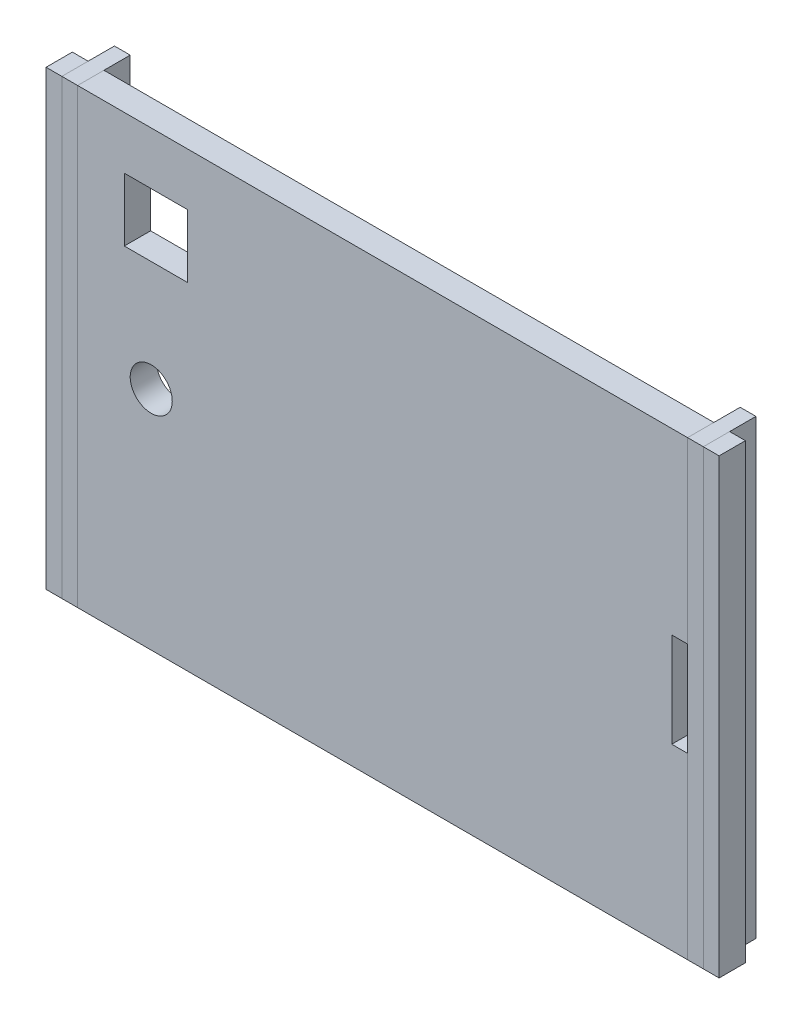
ISO-10303-21;
HEADER;
FILE_DESCRIPTION(('STEP AP214'),'2;1');
FILE_NAME('part.step','',(''),(''),'','','');
FILE_SCHEMA(('AUTOMOTIVE_DESIGN { 1 0 10303 214 1 1 1 1 }'));
ENDSEC;
DATA;
#1=APPLICATION_CONTEXT('core data for automotive mechanical design processes');
#2=APPLICATION_PROTOCOL_DEFINITION('international standard','automotive_design',2000,#1);
#3=PRODUCT_CONTEXT('',#1,'mechanical');
#4=PRODUCT('Part','Part','',(#3));
#5=PRODUCT_RELATED_PRODUCT_CATEGORY('part','',(#4));
#6=PRODUCT_DEFINITION_FORMATION('','',#4);
#7=PRODUCT_DEFINITION_CONTEXT('part definition',#1,'design');
#8=PRODUCT_DEFINITION('design','',#6,#7);
#9=PRODUCT_DEFINITION_SHAPE('','',#8);
#10=(LENGTH_UNIT() NAMED_UNIT(*) SI_UNIT(.MILLI.,.METRE.));
#11=(NAMED_UNIT(*) PLANE_ANGLE_UNIT() SI_UNIT($,.RADIAN.));
#12=(NAMED_UNIT(*) SI_UNIT($,.STERADIAN.) SOLID_ANGLE_UNIT());
#13=UNCERTAINTY_MEASURE_WITH_UNIT(LENGTH_MEASURE(1.E-05),#10,'distance_accuracy_value','');
#14=(GEOMETRIC_REPRESENTATION_CONTEXT(3) GLOBAL_UNCERTAINTY_ASSIGNED_CONTEXT((#13)) GLOBAL_UNIT_ASSIGNED_CONTEXT((#10,
#11,#12)) REPRESENTATION_CONTEXT('',''));
#15=CARTESIAN_POINT('',(0.,0.,0.));
#16=DIRECTION('',(0.,0.,1.));
#17=DIRECTION('',(1.,0.,0.));
#18=AXIS2_PLACEMENT_3D('',#15,#16,#17);
#19=CARTESIAN_POINT('',(0.,-37.7760362988326,-10.));
#20=DIRECTION('',(0.,-1.,0.));
#21=DIRECTION('',(1.,0.,0.));
#22=AXIS2_PLACEMENT_3D('',#19,#20,#21);
#23=PLANE('',#22);
#24=DIRECTION('',(1.,0.,0.));
#25=VECTOR('',#24,1.);
#26=CARTESIAN_POINT('',(0.,-37.7760362988326,0.));
#27=LINE('',#26,#25);
#28=CARTESIAN_POINT('',(18.7536611522235,-37.7760362988326,0.));
#29=VERTEX_POINT('',#28);
#30=CARTESIAN_POINT('',(21.7536611522235,-37.7760362988326,0.));
#31=VERTEX_POINT('',#30);
#32=EDGE_CURVE('E112',#29,#31,#27,.T.);
#33=ORIENTED_EDGE('',*,*,#32,.F.);
#34=DIRECTION('',(0.,0.,1.));
#35=VECTOR('',#34,1.);
#36=CARTESIAN_POINT('',(18.7536611522235,-37.7760362988326,-10.));
#37=LINE('',#36,#35);
#38=CARTESIAN_POINT('',(18.7536611522235,-37.7760362988326,-10.));
#39=VERTEX_POINT('',#38);
#40=EDGE_CURVE('E12',#39,#29,#37,.T.);
#41=ORIENTED_EDGE('',*,*,#40,.F.);
#42=DIRECTION('',(1.,0.,0.));
#43=VECTOR('',#42,1.);
#44=CARTESIAN_POINT('',(0.,-37.7760362988326,-10.));
#45=LINE('',#44,#43);
#46=CARTESIAN_POINT('',(21.7536611522235,-37.7760362988326,-10.));
#47=VERTEX_POINT('',#46);
#48=EDGE_CURVE('E106',#39,#47,#45,.T.);
#49=ORIENTED_EDGE('',*,*,#48,.T.);
#50=DIRECTION('',(0.,0.,1.));
#51=VECTOR('',#50,1.);
#52=CARTESIAN_POINT('',(21.7536611522235,-37.7760362988326,-10.));
#53=LINE('',#52,#51);
#54=EDGE_CURVE('E51',#47,#31,#53,.T.);
#55=ORIENTED_EDGE('',*,*,#54,.T.);
#56=EDGE_LOOP('',(#33,#41,#49,#55));
#57=FACE_BOUND('',#56,.T.);
#58=ADVANCED_FACE('F48',(#57),#23,.T.);
#59=CARTESIAN_POINT('',(18.7536611522235,0.,-10.));
#60=DIRECTION('',(-1.,0.,0.));
#61=DIRECTION('',(0.,-1.,0.));
#62=AXIS2_PLACEMENT_3D('',#59,#60,#61);
#63=PLANE('',#62);
#64=DIRECTION('',(0.,-1.,0.));
#65=VECTOR('',#64,1.);
#66=CARTESIAN_POINT('',(18.7536611522235,0.,0.));
#67=LINE('',#66,#65);
#68=CARTESIAN_POINT('',(18.7536611522235,48.2239637011674,0.));
#69=VERTEX_POINT('',#68);
#70=EDGE_CURVE('E108',#69,#29,#67,.T.);
#71=ORIENTED_EDGE('',*,*,#70,.F.);
#72=DIRECTION('',(0.,0.,1.));
#73=VECTOR('',#72,1.);
#74=CARTESIAN_POINT('',(18.7536611522235,48.2239637011674,-10.));
#75=LINE('',#74,#73);
#76=CARTESIAN_POINT('',(18.7536611522235,48.2239637011674,-10.));
#77=VERTEX_POINT('',#76);
#78=EDGE_CURVE('E57',#77,#69,#75,.T.);
#79=ORIENTED_EDGE('',*,*,#78,.F.);
#80=DIRECTION('',(0.,-1.,0.));
#81=VECTOR('',#80,1.);
#82=CARTESIAN_POINT('',(18.7536611522235,0.,-10.));
#83=LINE('',#82,#81);
#84=EDGE_CURVE('E99',#77,#39,#83,.T.);
#85=ORIENTED_EDGE('',*,*,#84,.T.);
#86=ORIENTED_EDGE('',*,*,#40,.T.);
#87=EDGE_LOOP('',(#71,#79,#85,#86));
#88=FACE_BOUND('',#87,.T.);
#89=ADVANCED_FACE('F122',(#88),#63,.T.);
#90=CARTESIAN_POINT('',(0.,48.2239637011674,-10.));
#91=DIRECTION('',(0.,-1.,0.));
#92=DIRECTION('',(0.,0.,-1.));
#93=AXIS2_PLACEMENT_3D('',#90,#91,#92);
#94=PLANE('',#93);
#95=DIRECTION('',(1.,0.,0.));
#96=VECTOR('',#95,1.);
#97=CARTESIAN_POINT('',(0.,48.2239637011674,0.));
#98=LINE('',#97,#96);
#99=CARTESIAN_POINT('',(21.7536611522235,48.2239637011674,0.));
#100=VERTEX_POINT('',#99);
#101=EDGE_CURVE('E103',#69,#100,#98,.T.);
#102=ORIENTED_EDGE('',*,*,#101,.T.);
#103=DIRECTION('',(0.,0.,1.));
#104=VECTOR('',#103,1.);
#105=CARTESIAN_POINT('',(21.7536611522235,48.2239637011674,-10.));
#106=LINE('',#105,#104);
#107=CARTESIAN_POINT('',(21.7536611522235,48.2239637011674,-10.));
#108=VERTEX_POINT('',#107);
#109=EDGE_CURVE('E101',#108,#100,#106,.T.);
#110=ORIENTED_EDGE('',*,*,#109,.F.);
#111=DIRECTION('',(1.,0.,0.));
#112=VECTOR('',#111,1.);
#113=CARTESIAN_POINT('',(0.,48.2239637011674,-10.));
#114=LINE('',#113,#112);
#115=EDGE_CURVE('E95',#77,#108,#114,.T.);
#116=ORIENTED_EDGE('',*,*,#115,.F.);
#117=ORIENTED_EDGE('',*,*,#78,.T.);
#118=EDGE_LOOP('',(#102,#110,#116,#117));
#119=FACE_BOUND('',#118,.T.);
#120=ADVANCED_FACE('F102',(#119),#94,.F.);
#121=CARTESIAN_POINT('',(21.7536611522235,0.,-10.));
#122=DIRECTION('',(1.,0.,0.));
#123=DIRECTION('',(0.,0.,-1.));
#124=AXIS2_PLACEMENT_3D('',#121,#122,#123);
#125=PLANE('',#124);
#126=DIRECTION('',(0.,1.,0.));
#127=VECTOR('',#126,1.);
#128=CARTESIAN_POINT('',(21.7536611522235,0.,0.));
#129=LINE('',#128,#127);
#130=EDGE_CURVE('E115',#31,#100,#129,.T.);
#131=ORIENTED_EDGE('',*,*,#130,.F.);
#132=ORIENTED_EDGE('',*,*,#54,.F.);
#133=DIRECTION('',(0.,1.,0.));
#134=VECTOR('',#133,1.);
#135=CARTESIAN_POINT('',(21.7536611522235,0.,-10.));
#136=LINE('',#135,#134);
#137=EDGE_CURVE('E98',#47,#108,#136,.T.);
#138=ORIENTED_EDGE('',*,*,#137,.T.);
#139=ORIENTED_EDGE('',*,*,#109,.T.);
#140=EDGE_LOOP('',(#131,#132,#138,#139));
#141=FACE_BOUND('',#140,.T.);
#142=ADVANCED_FACE('F105',(#141),#125,.T.);
#143=CARTESIAN_POINT('',(0.,0.,-10.));
#144=DIRECTION('',(0.,0.,1.));
#145=DIRECTION('',(1.,0.,0.));
#146=AXIS2_PLACEMENT_3D('',#143,#144,#145);
#147=PLANE('',#146);
#148=ORIENTED_EDGE('',*,*,#48,.F.);
#149=ORIENTED_EDGE('',*,*,#84,.F.);
#150=ORIENTED_EDGE('',*,*,#115,.T.);
#151=ORIENTED_EDGE('',*,*,#137,.F.);
#152=EDGE_LOOP('',(#148,#149,#150,#151));
#153=FACE_BOUND('',#152,.T.);
#154=ADVANCED_FACE('F97',(#153),#147,.F.);
#155=CARTESIAN_POINT('',(0.,0.,0.));
#156=DIRECTION('',(0.,0.,1.));
#157=DIRECTION('',(1.,0.,0.));
#158=AXIS2_PLACEMENT_3D('',#155,#156,#157);
#159=PLANE('',#158);
#160=ORIENTED_EDGE('',*,*,#32,.T.);
#161=ORIENTED_EDGE('',*,*,#130,.T.);
#162=ORIENTED_EDGE('',*,*,#101,.F.);
#163=ORIENTED_EDGE('',*,*,#70,.T.);
#164=EDGE_LOOP('',(#160,#161,#162,#163));
#165=FACE_BOUND('',#164,.T.);
#166=ADVANCED_FACE('F121',(#165),#159,.T.);
#167=CLOSED_SHELL('',(#58,#89,#120,#142,#154,#166));
#168=MANIFOLD_SOLID_BREP('B2',#167);
#169=CARTESIAN_POINT('',(-100.246338847777,0.,-10.));
#170=DIRECTION('',(1.,0.,0.));
#171=DIRECTION('',(0.,0.,-1.));
#172=AXIS2_PLACEMENT_3D('',#169,#170,#171);
#173=PLANE('',#172);
#174=DIRECTION('',(0.,1.,0.));
#175=VECTOR('',#174,1.);
#176=CARTESIAN_POINT('',(-100.246338847777,0.,0.));
#177=LINE('',#176,#175);
#178=CARTESIAN_POINT('',(-100.246338847777,-37.7760362988326,0.));
#179=VERTEX_POINT('',#178);
#180=CARTESIAN_POINT('',(-100.246338847777,48.2239637011674,0.));
#181=VERTEX_POINT('',#180);
#182=EDGE_CURVE('E255',#179,#181,#177,.T.);
#183=ORIENTED_EDGE('',*,*,#182,.T.);
#184=DIRECTION('',(0.,0.,1.));
#185=VECTOR('',#184,1.);
#186=CARTESIAN_POINT('',(-100.246338847777,48.2239637011674,-10.));
#187=LINE('',#186,#185);
#188=CARTESIAN_POINT('',(-100.246338847777,48.2239637011674,-10.));
#189=VERTEX_POINT('',#188);
#190=EDGE_CURVE('E46',#189,#181,#187,.T.);
#191=ORIENTED_EDGE('',*,*,#190,.F.);
#192=DIRECTION('',(0.,1.,0.));
#193=VECTOR('',#192,1.);
#194=CARTESIAN_POINT('',(-100.246338847777,0.,-10.));
#195=LINE('',#194,#193);
#196=CARTESIAN_POINT('',(-100.246338847777,-37.7760362988326,-10.));
#197=VERTEX_POINT('',#196);
#198=EDGE_CURVE('E250',#197,#189,#195,.T.);
#199=ORIENTED_EDGE('',*,*,#198,.F.);
#200=DIRECTION('',(0.,0.,1.));
#201=VECTOR('',#200,1.);
#202=CARTESIAN_POINT('',(-100.246338847777,-37.7760362988326,-10.));
#203=LINE('',#202,#201);
#204=EDGE_CURVE('E194',#197,#179,#203,.T.);
#205=ORIENTED_EDGE('',*,*,#204,.T.);
#206=EDGE_LOOP('',(#183,#191,#199,#205));
#207=FACE_BOUND('',#206,.T.);
#208=ADVANCED_FACE('F191',(#207),#173,.F.);
#209=CARTESIAN_POINT('',(0.,48.2239637011674,-10.));
#210=DIRECTION('',(0.,-1.,0.));
#211=DIRECTION('',(0.,0.,-1.));
#212=AXIS2_PLACEMENT_3D('',#209,#210,#211);
#213=PLANE('',#212);
#214=DIRECTION('',(1.,0.,0.));
#215=VECTOR('',#214,1.);
#216=CARTESIAN_POINT('',(0.,48.2239637011674,0.));
#217=LINE('',#216,#215);
#218=CARTESIAN_POINT('',(-97.2463388477765,48.2239637011674,0.));
#219=VERTEX_POINT('',#218);
#220=EDGE_CURVE('E222',#181,#219,#217,.T.);
#221=ORIENTED_EDGE('',*,*,#220,.T.);
#222=DIRECTION('',(0.,0.,1.));
#223=VECTOR('',#222,1.);
#224=CARTESIAN_POINT('',(-97.2463388477765,48.2239637011674,-10.));
#225=LINE('',#224,#223);
#226=CARTESIAN_POINT('',(-97.2463388477765,48.2239637011674,-10.));
#227=VERTEX_POINT('',#226);
#228=EDGE_CURVE('E200',#227,#219,#225,.T.);
#229=ORIENTED_EDGE('',*,*,#228,.F.);
#230=DIRECTION('',(1.,0.,0.));
#231=VECTOR('',#230,1.);
#232=CARTESIAN_POINT('',(0.,48.2239637011674,-10.));
#233=LINE('',#232,#231);
#234=EDGE_CURVE('E208',#189,#227,#233,.T.);
#235=ORIENTED_EDGE('',*,*,#234,.F.);
#236=ORIENTED_EDGE('',*,*,#190,.T.);
#237=EDGE_LOOP('',(#221,#229,#235,#236));
#238=FACE_BOUND('',#237,.T.);
#239=ADVANCED_FACE('F265',(#238),#213,.F.);
#240=CARTESIAN_POINT('',(-97.2463388477765,0.,-10.));
#241=DIRECTION('',(-1.,0.,0.));
#242=DIRECTION('',(0.,-1.,0.));
#243=AXIS2_PLACEMENT_3D('',#240,#241,#242);
#244=PLANE('',#243);
#245=DIRECTION('',(0.,-1.,0.));
#246=VECTOR('',#245,1.);
#247=CARTESIAN_POINT('',(-97.2463388477765,0.,0.));
#248=LINE('',#247,#246);
#249=CARTESIAN_POINT('',(-97.2463388477765,-37.7760362988326,0.));
#250=VERTEX_POINT('',#249);
#251=EDGE_CURVE('E247',#219,#250,#248,.T.);
#252=ORIENTED_EDGE('',*,*,#251,.T.);
#253=DIRECTION('',(0.,0.,1.));
#254=VECTOR('',#253,1.);
#255=CARTESIAN_POINT('',(-97.2463388477765,-37.7760362988326,-10.));
#256=LINE('',#255,#254);
#257=CARTESIAN_POINT('',(-97.2463388477765,-37.7760362988326,-10.));
#258=VERTEX_POINT('',#257);
#259=EDGE_CURVE('E245',#258,#250,#256,.T.);
#260=ORIENTED_EDGE('',*,*,#259,.F.);
#261=DIRECTION('',(0.,-1.,0.));
#262=VECTOR('',#261,1.);
#263=CARTESIAN_POINT('',(-97.2463388477765,0.,-10.));
#264=LINE('',#263,#262);
#265=EDGE_CURVE('E238',#227,#258,#264,.T.);
#266=ORIENTED_EDGE('',*,*,#265,.F.);
#267=ORIENTED_EDGE('',*,*,#228,.T.);
#268=EDGE_LOOP('',(#252,#260,#266,#267));
#269=FACE_BOUND('',#268,.T.);
#270=ADVANCED_FACE('F246',(#269),#244,.F.);
#271=CARTESIAN_POINT('',(0.,-37.7760362988326,-10.));
#272=DIRECTION('',(0.,-1.,0.));
#273=DIRECTION('',(1.,0.,0.));
#274=AXIS2_PLACEMENT_3D('',#271,#272,#273);
#275=PLANE('',#274);
#276=DIRECTION('',(1.,0.,0.));
#277=VECTOR('',#276,1.);
#278=CARTESIAN_POINT('',(0.,-37.7760362988326,0.));
#279=LINE('',#278,#277);
#280=EDGE_CURVE('E258',#179,#250,#279,.T.);
#281=ORIENTED_EDGE('',*,*,#280,.F.);
#282=ORIENTED_EDGE('',*,*,#204,.F.);
#283=DIRECTION('',(1.,0.,0.));
#284=VECTOR('',#283,1.);
#285=CARTESIAN_POINT('',(0.,-37.7760362988326,-10.));
#286=LINE('',#285,#284);
#287=EDGE_CURVE('E241',#197,#258,#286,.T.);
#288=ORIENTED_EDGE('',*,*,#287,.T.);
#289=ORIENTED_EDGE('',*,*,#259,.T.);
#290=EDGE_LOOP('',(#281,#282,#288,#289));
#291=FACE_BOUND('',#290,.T.);
#292=ADVANCED_FACE('F249',(#291),#275,.T.);
#293=CARTESIAN_POINT('',(0.,0.,-10.));
#294=DIRECTION('',(0.,0.,1.));
#295=DIRECTION('',(1.,0.,0.));
#296=AXIS2_PLACEMENT_3D('',#293,#294,#295);
#297=PLANE('',#296);
#298=ORIENTED_EDGE('',*,*,#198,.T.);
#299=ORIENTED_EDGE('',*,*,#234,.T.);
#300=ORIENTED_EDGE('',*,*,#265,.T.);
#301=ORIENTED_EDGE('',*,*,#287,.F.);
#302=EDGE_LOOP('',(#298,#299,#300,#301));
#303=FACE_BOUND('',#302,.T.);
#304=ADVANCED_FACE('F240',(#303),#297,.F.);
#305=CARTESIAN_POINT('',(0.,0.,0.));
#306=DIRECTION('',(0.,0.,1.));
#307=DIRECTION('',(1.,0.,0.));
#308=AXIS2_PLACEMENT_3D('',#305,#306,#307);
#309=PLANE('',#308);
#310=ORIENTED_EDGE('',*,*,#182,.F.);
#311=ORIENTED_EDGE('',*,*,#280,.T.);
#312=ORIENTED_EDGE('',*,*,#251,.F.);
#313=ORIENTED_EDGE('',*,*,#220,.F.);
#314=EDGE_LOOP('',(#310,#311,#312,#313));
#315=FACE_BOUND('',#314,.T.);
#316=ADVANCED_FACE('F262',(#315),#309,.T.);
#317=CLOSED_SHELL('',(#208,#239,#270,#292,#304,#316));
#318=MANIFOLD_SOLID_BREP('B6',#317);
#319=CARTESIAN_POINT('',(21.7536611522235,0.,-5.));
#320=DIRECTION('',(1.,0.,0.));
#321=DIRECTION('',(0.,0.,-1.));
#322=AXIS2_PLACEMENT_3D('',#319,#320,#321);
#323=PLANE('',#322);
#324=DIRECTION('',(0.,1.,0.));
#325=VECTOR('',#324,1.);
#326=CARTESIAN_POINT('',(21.7536611522235,0.,0.));
#327=LINE('',#326,#325);
#328=CARTESIAN_POINT('',(21.7536611522235,-37.7760362988326,0.));
#329=VERTEX_POINT('',#328);
#330=CARTESIAN_POINT('',(21.7536611522235,48.2239637011674,0.));
#331=VERTEX_POINT('',#330);
#332=EDGE_CURVE('E395',#329,#331,#327,.T.);
#333=ORIENTED_EDGE('',*,*,#332,.T.);
#334=DIRECTION('',(0.,0.,1.));
#335=VECTOR('',#334,1.);
#336=CARTESIAN_POINT('',(21.7536611522235,48.2239637011674,-5.));
#337=LINE('',#336,#335);
#338=CARTESIAN_POINT('',(21.7536611522235,48.2239637011674,-5.));
#339=VERTEX_POINT('',#338);
#340=EDGE_CURVE('E189',#339,#331,#337,.T.);
#341=ORIENTED_EDGE('',*,*,#340,.F.);
#342=DIRECTION('',(0.,1.,0.));
#343=VECTOR('',#342,1.);
#344=CARTESIAN_POINT('',(21.7536611522235,0.,-5.));
#345=LINE('',#344,#343);
#346=CARTESIAN_POINT('',(21.7536611522235,-37.7760362988326,-5.));
#347=VERTEX_POINT('',#346);
#348=EDGE_CURVE('E390',#347,#339,#345,.T.);
#349=ORIENTED_EDGE('',*,*,#348,.F.);
#350=DIRECTION('',(0.,0.,1.));
#351=VECTOR('',#350,1.);
#352=CARTESIAN_POINT('',(21.7536611522235,-37.7760362988326,-5.));
#353=LINE('',#352,#351);
#354=EDGE_CURVE('E334',#347,#329,#353,.T.);
#355=ORIENTED_EDGE('',*,*,#354,.T.);
#356=EDGE_LOOP('',(#333,#341,#349,#355));
#357=FACE_BOUND('',#356,.T.);
#358=ADVANCED_FACE('F331',(#357),#323,.F.);
#359=CARTESIAN_POINT('',(0.,48.2239637011674,-5.));
#360=DIRECTION('',(0.,-1.,0.));
#361=DIRECTION('',(0.,0.,-1.));
#362=AXIS2_PLACEMENT_3D('',#359,#360,#361);
#363=PLANE('',#362);
#364=DIRECTION('',(1.,0.,0.));
#365=VECTOR('',#364,1.);
#366=CARTESIAN_POINT('',(0.,48.2239637011674,0.));
#367=LINE('',#366,#365);
#368=CARTESIAN_POINT('',(24.7536611522235,48.2239637011674,0.));
#369=VERTEX_POINT('',#368);
#370=EDGE_CURVE('E362',#331,#369,#367,.T.);
#371=ORIENTED_EDGE('',*,*,#370,.T.);
#372=DIRECTION('',(0.,0.,1.));
#373=VECTOR('',#372,1.);
#374=CARTESIAN_POINT('',(24.7536611522235,48.2239637011674,-5.));
#375=LINE('',#374,#373);
#376=CARTESIAN_POINT('',(24.7536611522235,48.2239637011674,-5.));
#377=VERTEX_POINT('',#376);
#378=EDGE_CURVE('E340',#377,#369,#375,.T.);
#379=ORIENTED_EDGE('',*,*,#378,.F.);
#380=DIRECTION('',(1.,0.,0.));
#381=VECTOR('',#380,1.);
#382=CARTESIAN_POINT('',(0.,48.2239637011674,-5.));
#383=LINE('',#382,#381);
#384=EDGE_CURVE('E348',#339,#377,#383,.T.);
#385=ORIENTED_EDGE('',*,*,#384,.F.);
#386=ORIENTED_EDGE('',*,*,#340,.T.);
#387=EDGE_LOOP('',(#371,#379,#385,#386));
#388=FACE_BOUND('',#387,.T.);
#389=ADVANCED_FACE('F405',(#388),#363,.F.);
#390=CARTESIAN_POINT('',(24.7536611522235,0.,-5.));
#391=DIRECTION('',(-1.,0.,0.));
#392=DIRECTION('',(0.,-1.,0.));
#393=AXIS2_PLACEMENT_3D('',#390,#391,#392);
#394=PLANE('',#393);
#395=DIRECTION('',(0.,-1.,0.));
#396=VECTOR('',#395,1.);
#397=CARTESIAN_POINT('',(24.7536611522235,0.,0.));
#398=LINE('',#397,#396);
#399=CARTESIAN_POINT('',(24.7536611522235,-37.7760362988326,0.));
#400=VERTEX_POINT('',#399);
#401=EDGE_CURVE('E387',#369,#400,#398,.T.);
#402=ORIENTED_EDGE('',*,*,#401,.T.);
#403=DIRECTION('',(0.,0.,1.));
#404=VECTOR('',#403,1.);
#405=CARTESIAN_POINT('',(24.7536611522235,-37.7760362988326,-5.));
#406=LINE('',#405,#404);
#407=CARTESIAN_POINT('',(24.7536611522235,-37.7760362988326,-5.));
#408=VERTEX_POINT('',#407);
#409=EDGE_CURVE('E385',#408,#400,#406,.T.);
#410=ORIENTED_EDGE('',*,*,#409,.F.);
#411=DIRECTION('',(0.,-1.,0.));
#412=VECTOR('',#411,1.);
#413=CARTESIAN_POINT('',(24.7536611522235,0.,-5.));
#414=LINE('',#413,#412);
#415=EDGE_CURVE('E378',#377,#408,#414,.T.);
#416=ORIENTED_EDGE('',*,*,#415,.F.);
#417=ORIENTED_EDGE('',*,*,#378,.T.);
#418=EDGE_LOOP('',(#402,#410,#416,#417));
#419=FACE_BOUND('',#418,.T.);
#420=ADVANCED_FACE('F386',(#419),#394,.F.);
#421=CARTESIAN_POINT('',(0.,-37.7760362988326,-5.));
#422=DIRECTION('',(0.,-1.,0.));
#423=DIRECTION('',(1.,0.,0.));
#424=AXIS2_PLACEMENT_3D('',#421,#422,#423);
#425=PLANE('',#424);
#426=DIRECTION('',(1.,0.,0.));
#427=VECTOR('',#426,1.);
#428=CARTESIAN_POINT('',(0.,-37.7760362988326,0.));
#429=LINE('',#428,#427);
#430=EDGE_CURVE('E398',#329,#400,#429,.T.);
#431=ORIENTED_EDGE('',*,*,#430,.F.);
#432=ORIENTED_EDGE('',*,*,#354,.F.);
#433=DIRECTION('',(1.,0.,0.));
#434=VECTOR('',#433,1.);
#435=CARTESIAN_POINT('',(0.,-37.7760362988326,-5.));
#436=LINE('',#435,#434);
#437=EDGE_CURVE('E381',#347,#408,#436,.T.);
#438=ORIENTED_EDGE('',*,*,#437,.T.);
#439=ORIENTED_EDGE('',*,*,#409,.T.);
#440=EDGE_LOOP('',(#431,#432,#438,#439));
#441=FACE_BOUND('',#440,.T.);
#442=ADVANCED_FACE('F389',(#441),#425,.T.);
#443=CARTESIAN_POINT('',(0.,0.,-5.));
#444=DIRECTION('',(0.,0.,1.));
#445=DIRECTION('',(1.,0.,0.));
#446=AXIS2_PLACEMENT_3D('',#443,#444,#445);
#447=PLANE('',#446);
#448=ORIENTED_EDGE('',*,*,#348,.T.);
#449=ORIENTED_EDGE('',*,*,#384,.T.);
#450=ORIENTED_EDGE('',*,*,#415,.T.);
#451=ORIENTED_EDGE('',*,*,#437,.F.);
#452=EDGE_LOOP('',(#448,#449,#450,#451));
#453=FACE_BOUND('',#452,.T.);
#454=ADVANCED_FACE('F380',(#453),#447,.F.);
#455=CARTESIAN_POINT('',(0.,0.,0.));
#456=DIRECTION('',(0.,0.,1.));
#457=DIRECTION('',(1.,0.,0.));
#458=AXIS2_PLACEMENT_3D('',#455,#456,#457);
#459=PLANE('',#458);
#460=ORIENTED_EDGE('',*,*,#332,.F.);
#461=ORIENTED_EDGE('',*,*,#430,.T.);
#462=ORIENTED_EDGE('',*,*,#401,.F.);
#463=ORIENTED_EDGE('',*,*,#370,.F.);
#464=EDGE_LOOP('',(#460,#461,#462,#463));
#465=FACE_BOUND('',#464,.T.);
#466=ADVANCED_FACE('F402',(#465),#459,.T.);
#467=CLOSED_SHELL('',(#358,#389,#420,#442,#454,#466));
#468=MANIFOLD_SOLID_BREP('B40',#467);
#469=CARTESIAN_POINT('',(0.,-37.7760362988326,-5.));
#470=DIRECTION('',(0.,-1.,0.));
#471=DIRECTION('',(1.,0.,0.));
#472=AXIS2_PLACEMENT_3D('',#469,#470,#471);
#473=PLANE('',#472);
#474=DIRECTION('',(1.,0.,0.));
#475=VECTOR('',#474,1.);
#476=CARTESIAN_POINT('',(0.,-37.7760362988326,0.));
#477=LINE('',#476,#475);
#478=CARTESIAN_POINT('',(-103.246338847777,-37.7760362988326,0.));
#479=VERTEX_POINT('',#478);
#480=CARTESIAN_POINT('',(-100.246338847777,-37.7760362988326,0.));
#481=VERTEX_POINT('',#480);
#482=EDGE_CURVE('E528',#479,#481,#477,.T.);
#483=ORIENTED_EDGE('',*,*,#482,.F.);
#484=DIRECTION('',(0.,0.,1.));
#485=VECTOR('',#484,1.);
#486=CARTESIAN_POINT('',(-103.246338847777,-37.7760362988326,-5.));
#487=LINE('',#486,#485);
#488=CARTESIAN_POINT('',(-103.246338847777,-37.7760362988326,-5.));
#489=VERTEX_POINT('',#488);
#490=EDGE_CURVE('E329',#489,#479,#487,.T.);
#491=ORIENTED_EDGE('',*,*,#490,.F.);
#492=DIRECTION('',(1.,0.,0.));
#493=VECTOR('',#492,1.);
#494=CARTESIAN_POINT('',(0.,-37.7760362988326,-5.));
#495=LINE('',#494,#493);
#496=CARTESIAN_POINT('',(-100.246338847777,-37.7760362988326,-5.));
#497=VERTEX_POINT('',#496);
#498=EDGE_CURVE('E522',#489,#497,#495,.T.);
#499=ORIENTED_EDGE('',*,*,#498,.T.);
#500=DIRECTION('',(0.,0.,1.));
#501=VECTOR('',#500,1.);
#502=CARTESIAN_POINT('',(-100.246338847777,-37.7760362988326,-5.));
#503=LINE('',#502,#501);
#504=EDGE_CURVE('E467',#497,#481,#503,.T.);
#505=ORIENTED_EDGE('',*,*,#504,.T.);
#506=EDGE_LOOP('',(#483,#491,#499,#505));
#507=FACE_BOUND('',#506,.T.);
#508=ADVANCED_FACE('F464',(#507),#473,.T.);
#509=CARTESIAN_POINT('',(-103.246338847777,0.,-5.));
#510=DIRECTION('',(-1.,0.,0.));
#511=DIRECTION('',(0.,0.,1.));
#512=AXIS2_PLACEMENT_3D('',#509,#510,#511);
#513=PLANE('',#512);
#514=DIRECTION('',(0.,-1.,0.));
#515=VECTOR('',#514,1.);
#516=CARTESIAN_POINT('',(-103.246338847777,0.,0.));
#517=LINE('',#516,#515);
#518=CARTESIAN_POINT('',(-103.246338847777,48.2239637011674,0.));
#519=VERTEX_POINT('',#518);
#520=EDGE_CURVE('E524',#519,#479,#517,.T.);
#521=ORIENTED_EDGE('',*,*,#520,.F.);
#522=DIRECTION('',(0.,0.,1.));
#523=VECTOR('',#522,1.);
#524=CARTESIAN_POINT('',(-103.246338847777,48.2239637011674,-5.));
#525=LINE('',#524,#523);
#526=CARTESIAN_POINT('',(-103.246338847777,48.2239637011674,-5.));
#527=VERTEX_POINT('',#526);
#528=EDGE_CURVE('E473',#527,#519,#525,.T.);
#529=ORIENTED_EDGE('',*,*,#528,.F.);
#530=DIRECTION('',(0.,-1.,0.));
#531=VECTOR('',#530,1.);
#532=CARTESIAN_POINT('',(-103.246338847777,0.,-5.));
#533=LINE('',#532,#531);
#534=EDGE_CURVE('E515',#527,#489,#533,.T.);
#535=ORIENTED_EDGE('',*,*,#534,.T.);
#536=ORIENTED_EDGE('',*,*,#490,.T.);
#537=EDGE_LOOP('',(#521,#529,#535,#536));
#538=FACE_BOUND('',#537,.T.);
#539=ADVANCED_FACE('F538',(#538),#513,.T.);
#540=CARTESIAN_POINT('',(0.,48.2239637011674,-5.));
#541=DIRECTION('',(0.,-1.,0.));
#542=DIRECTION('',(0.,0.,-1.));
#543=AXIS2_PLACEMENT_3D('',#540,#541,#542);
#544=PLANE('',#543);
#545=DIRECTION('',(1.,0.,0.));
#546=VECTOR('',#545,1.);
#547=CARTESIAN_POINT('',(0.,48.2239637011674,0.));
#548=LINE('',#547,#546);
#549=CARTESIAN_POINT('',(-100.246338847777,48.2239637011674,0.));
#550=VERTEX_POINT('',#549);
#551=EDGE_CURVE('E519',#519,#550,#548,.T.);
#552=ORIENTED_EDGE('',*,*,#551,.T.);
#553=DIRECTION('',(0.,0.,1.));
#554=VECTOR('',#553,1.);
#555=CARTESIAN_POINT('',(-100.246338847777,48.2239637011674,-5.));
#556=LINE('',#555,#554);
#557=CARTESIAN_POINT('',(-100.246338847777,48.2239637011674,-5.));
#558=VERTEX_POINT('',#557);
#559=EDGE_CURVE('E517',#558,#550,#556,.T.);
#560=ORIENTED_EDGE('',*,*,#559,.F.);
#561=DIRECTION('',(1.,0.,0.));
#562=VECTOR('',#561,1.);
#563=CARTESIAN_POINT('',(0.,48.2239637011674,-5.));
#564=LINE('',#563,#562);
#565=EDGE_CURVE('E511',#527,#558,#564,.T.);
#566=ORIENTED_EDGE('',*,*,#565,.F.);
#567=ORIENTED_EDGE('',*,*,#528,.T.);
#568=EDGE_LOOP('',(#552,#560,#566,#567));
#569=FACE_BOUND('',#568,.T.);
#570=ADVANCED_FACE('F518',(#569),#544,.F.);
#571=CARTESIAN_POINT('',(-100.246338847777,0.,-5.));
#572=DIRECTION('',(1.,0.,0.));
#573=DIRECTION('',(0.,0.,-1.));
#574=AXIS2_PLACEMENT_3D('',#571,#572,#573);
#575=PLANE('',#574);
#576=DIRECTION('',(0.,1.,0.));
#577=VECTOR('',#576,1.);
#578=CARTESIAN_POINT('',(-100.246338847777,0.,0.));
#579=LINE('',#578,#577);
#580=EDGE_CURVE('E531',#481,#550,#579,.T.);
#581=ORIENTED_EDGE('',*,*,#580,.F.);
#582=ORIENTED_EDGE('',*,*,#504,.F.);
#583=DIRECTION('',(0.,1.,0.));
#584=VECTOR('',#583,1.);
#585=CARTESIAN_POINT('',(-100.246338847777,0.,-5.));
#586=LINE('',#585,#584);
#587=EDGE_CURVE('E514',#497,#558,#586,.T.);
#588=ORIENTED_EDGE('',*,*,#587,.T.);
#589=ORIENTED_EDGE('',*,*,#559,.T.);
#590=EDGE_LOOP('',(#581,#582,#588,#589));
#591=FACE_BOUND('',#590,.T.);
#592=ADVANCED_FACE('F521',(#591),#575,.T.);
#593=CARTESIAN_POINT('',(0.,0.,-5.));
#594=DIRECTION('',(0.,0.,1.));
#595=DIRECTION('',(1.,0.,0.));
#596=AXIS2_PLACEMENT_3D('',#593,#594,#595);
#597=PLANE('',#596);
#598=ORIENTED_EDGE('',*,*,#498,.F.);
#599=ORIENTED_EDGE('',*,*,#534,.F.);
#600=ORIENTED_EDGE('',*,*,#565,.T.);
#601=ORIENTED_EDGE('',*,*,#587,.F.);
#602=EDGE_LOOP('',(#598,#599,#600,#601));
#603=FACE_BOUND('',#602,.T.);
#604=ADVANCED_FACE('F513',(#603),#597,.F.);
#605=CARTESIAN_POINT('',(0.,0.,0.));
#606=DIRECTION('',(0.,0.,1.));
#607=DIRECTION('',(1.,0.,0.));
#608=AXIS2_PLACEMENT_3D('',#605,#606,#607);
#609=PLANE('',#608);
#610=ORIENTED_EDGE('',*,*,#482,.T.);
#611=ORIENTED_EDGE('',*,*,#580,.T.);
#612=ORIENTED_EDGE('',*,*,#551,.F.);
#613=ORIENTED_EDGE('',*,*,#520,.T.);
#614=EDGE_LOOP('',(#610,#611,#612,#613));
#615=FACE_BOUND('',#614,.T.);
#616=ADVANCED_FACE('F537',(#615),#609,.T.);
#617=CLOSED_SHELL('',(#508,#539,#570,#592,#604,#616));
#618=MANIFOLD_SOLID_BREP('B183',#617);
#619=CARTESIAN_POINT('',(0.,26.2239637011674,-5.));
#620=DIRECTION('',(0.,1.,0.));
#621=DIRECTION('',(0.,0.,1.));
#622=AXIS2_PLACEMENT_3D('',#619,#620,#621);
#623=PLANE('',#622);
#624=DIRECTION('',(-1.,0.,0.));
#625=VECTOR('',#624,1.);
#626=CARTESIAN_POINT('',(0.,26.2239637011674,0.));
#627=LINE('',#626,#625);
#628=CARTESIAN_POINT('',(-76.3638859020008,26.2239637011674,0.));
#629=VERTEX_POINT('',#628);
#630=CARTESIAN_POINT('',(-88.3638859020008,26.2239637011674,0.));
#631=VERTEX_POINT('',#630);
#632=EDGE_CURVE('E735',#629,#631,#627,.T.);
#633=ORIENTED_EDGE('',*,*,#632,.F.);
#634=DIRECTION('',(0.,0.,1.));
#635=VECTOR('',#634,1.);
#636=CARTESIAN_POINT('',(-76.3638859020008,26.2239637011674,-5.));
#637=LINE('',#636,#635);
#638=CARTESIAN_POINT('',(-76.3638859020008,26.2239637011674,-5.));
#639=VERTEX_POINT('',#638);
#640=EDGE_CURVE('E462',#639,#629,#637,.T.);
#641=ORIENTED_EDGE('',*,*,#640,.F.);
#642=DIRECTION('',(-1.,0.,0.));
#643=VECTOR('',#642,1.);
#644=CARTESIAN_POINT('',(0.,26.2239637011674,-5.));
#645=LINE('',#644,#643);
#646=CARTESIAN_POINT('',(-88.3638859020008,26.2239637011674,-5.));
#647=VERTEX_POINT('',#646);
#648=EDGE_CURVE('E705',#639,#647,#645,.T.);
#649=ORIENTED_EDGE('',*,*,#648,.T.);
#650=DIRECTION('',(0.,0.,1.));
#651=VECTOR('',#650,1.);
#652=CARTESIAN_POINT('',(-88.3638859020008,26.2239637011674,-5.));
#653=LINE('',#652,#651);
#654=EDGE_CURVE('E702',#647,#631,#653,.T.);
#655=ORIENTED_EDGE('',*,*,#654,.T.);
#656=EDGE_LOOP('',(#633,#641,#649,#655));
#657=FACE_BOUND('',#656,.T.);
#658=ADVANCED_FACE('F588',(#657),#623,.T.);
#659=CARTESIAN_POINT('',(-76.3638859020008,0.,-5.));
#660=DIRECTION('',(1.,0.,0.));
#661=DIRECTION('',(0.,0.,-1.));
#662=AXIS2_PLACEMENT_3D('',#659,#660,#661);
#663=PLANE('',#662);
#664=DIRECTION('',(0.,1.,0.));
#665=VECTOR('',#664,1.);
#666=CARTESIAN_POINT('',(-76.3638859020008,0.,0.));
#667=LINE('',#666,#665);
#668=CARTESIAN_POINT('',(-76.3638859020008,38.2239637011674,0.));
#669=VERTEX_POINT('',#668);
#670=EDGE_CURVE('E741',#629,#669,#667,.T.);
#671=ORIENTED_EDGE('',*,*,#670,.T.);
#672=DIRECTION('',(0.,0.,1.));
#673=VECTOR('',#672,1.);
#674=CARTESIAN_POINT('',(-76.3638859020008,38.2239637011674,-5.));
#675=LINE('',#674,#673);
#676=CARTESIAN_POINT('',(-76.3638859020008,38.2239637011674,-5.));
#677=VERTEX_POINT('',#676);
#678=EDGE_CURVE('E598',#677,#669,#675,.T.);
#679=ORIENTED_EDGE('',*,*,#678,.F.);
#680=DIRECTION('',(0.,1.,0.));
#681=VECTOR('',#680,1.);
#682=CARTESIAN_POINT('',(-76.3638859020008,0.,-5.));
#683=LINE('',#682,#681);
#684=EDGE_CURVE('E694',#639,#677,#683,.T.);
#685=ORIENTED_EDGE('',*,*,#684,.F.);
#686=ORIENTED_EDGE('',*,*,#640,.T.);
#687=EDGE_LOOP('',(#671,#679,#685,#686));
#688=FACE_BOUND('',#687,.T.);
#689=ADVANCED_FACE('F822',(#688),#663,.F.);
#690=CARTESIAN_POINT('',(0.,38.2239637011674,-5.));
#691=DIRECTION('',(0.,1.,0.));
#692=DIRECTION('',(-1.,0.,0.));
#693=AXIS2_PLACEMENT_3D('',#690,#691,#692);
#694=PLANE('',#693);
#695=DIRECTION('',(-1.,0.,0.));
#696=VECTOR('',#695,1.);
#697=CARTESIAN_POINT('',(0.,38.2239637011674,0.));
#698=LINE('',#697,#696);
#699=CARTESIAN_POINT('',(-88.3638859020008,38.2239637011674,0.));
#700=VERTEX_POINT('',#699);
#701=EDGE_CURVE('E647',#669,#700,#698,.T.);
#702=ORIENTED_EDGE('',*,*,#701,.T.);
#703=DIRECTION('',(0.,0.,1.));
#704=VECTOR('',#703,1.);
#705=CARTESIAN_POINT('',(-88.3638859020008,38.2239637011674,-5.));
#706=LINE('',#705,#704);
#707=CARTESIAN_POINT('',(-88.3638859020008,38.2239637011674,-5.));
#708=VERTEX_POINT('',#707);
#709=EDGE_CURVE('E698',#708,#700,#706,.T.);
#710=ORIENTED_EDGE('',*,*,#709,.F.);
#711=DIRECTION('',(-1.,0.,0.));
#712=VECTOR('',#711,1.);
#713=CARTESIAN_POINT('',(0.,38.2239637011674,-5.));
#714=LINE('',#713,#712);
#715=EDGE_CURVE('E688',#677,#708,#714,.T.);
#716=ORIENTED_EDGE('',*,*,#715,.F.);
#717=ORIENTED_EDGE('',*,*,#678,.T.);
#718=EDGE_LOOP('',(#702,#710,#716,#717));
#719=FACE_BOUND('',#718,.T.);
#720=ADVANCED_FACE('F699',(#719),#694,.F.);
#721=CARTESIAN_POINT('',(0.,-3.77603629883262,-5.));
#722=DIRECTION('',(0.,-1.,0.));
#723=DIRECTION('',(1.,0.,0.));
#724=AXIS2_PLACEMENT_3D('',#721,#722,#723);
#725=PLANE('',#724);
#726=DIRECTION('',(1.,0.,0.));
#727=VECTOR('',#726,1.);
#728=CARTESIAN_POINT('',(0.,-3.77603629883262,0.));
#729=LINE('',#728,#727);
#730=CARTESIAN_POINT('',(15.7536611522235,-3.77603629883262,0.));
#731=VERTEX_POINT('',#730);
#732=CARTESIAN_POINT('',(18.7536611522235,-3.77603629883262,0.));
#733=VERTEX_POINT('',#732);
#734=EDGE_CURVE('E715',#731,#733,#729,.T.);
#735=ORIENTED_EDGE('',*,*,#734,.T.);
#736=DIRECTION('',(0.,0.,1.));
#737=VECTOR('',#736,1.);
#738=CARTESIAN_POINT('',(18.7536611522235,-3.77603629883262,-5.));
#739=LINE('',#738,#737);
#740=CARTESIAN_POINT('',(18.7536611522235,-3.77603629883262,-5.));
#741=VERTEX_POINT('',#740);
#742=EDGE_CURVE('E746',#741,#733,#739,.T.);
#743=ORIENTED_EDGE('',*,*,#742,.F.);
#744=DIRECTION('',(1.,0.,0.));
#745=VECTOR('',#744,1.);
#746=CARTESIAN_POINT('',(0.,-3.77603629883262,-5.));
#747=LINE('',#746,#745);
#748=CARTESIAN_POINT('',(15.7536611522235,-3.77603629883262,-5.));
#749=VERTEX_POINT('',#748);
#750=EDGE_CURVE('E768',#749,#741,#747,.T.);
#751=ORIENTED_EDGE('',*,*,#750,.F.);
#752=DIRECTION('',(0.,0.,1.));
#753=VECTOR('',#752,1.);
#754=CARTESIAN_POINT('',(15.7536611522235,-3.77603629883262,-5.));
#755=LINE('',#754,#753);
#756=EDGE_CURVE('E592',#749,#731,#755,.T.);
#757=ORIENTED_EDGE('',*,*,#756,.T.);
#758=EDGE_LOOP('',(#735,#743,#751,#757));
#759=FACE_BOUND('',#758,.T.);
#760=ADVANCED_FACE('F766',(#759),#725,.F.);
#761=CARTESIAN_POINT('',(18.7536611522235,0.,-5.));
#762=DIRECTION('',(-1.,0.,0.));
#763=DIRECTION('',(0.,-1.,0.));
#764=AXIS2_PLACEMENT_3D('',#761,#762,#763);
#765=PLANE('',#764);
#766=DIRECTION('',(0.,-1.,0.));
#767=VECTOR('',#766,1.);
#768=CARTESIAN_POINT('',(18.7536611522235,0.,0.));
#769=LINE('',#768,#767);
#770=CARTESIAN_POINT('',(18.7536611522235,-37.7760362988326,0.));
#771=VERTEX_POINT('',#770);
#772=EDGE_CURVE('E727',#733,#771,#769,.T.);
#773=ORIENTED_EDGE('',*,*,#772,.T.);
#774=DIRECTION('',(0.,0.,1.));
#775=VECTOR('',#774,1.);
#776=CARTESIAN_POINT('',(18.7536611522235,-37.7760362988326,-5.));
#777=LINE('',#776,#775);
#778=CARTESIAN_POINT('',(18.7536611522235,-37.7760362988326,-5.));
#779=VERTEX_POINT('',#778);
#780=EDGE_CURVE('E749',#779,#771,#777,.T.);
#781=ORIENTED_EDGE('',*,*,#780,.F.);
#782=DIRECTION('',(0.,-1.,0.));
#783=VECTOR('',#782,1.);
#784=CARTESIAN_POINT('',(18.7536611522235,0.,-5.));
#785=LINE('',#784,#783);
#786=EDGE_CURVE('E707',#741,#779,#785,.T.);
#787=ORIENTED_EDGE('',*,*,#786,.F.);
#788=ORIENTED_EDGE('',*,*,#742,.T.);
#789=EDGE_LOOP('',(#773,#781,#787,#788));
#790=FACE_BOUND('',#789,.T.);
#791=ADVANCED_FACE('F776',(#790),#765,.F.);
#792=CARTESIAN_POINT('',(0.,-37.7760362988326,-5.));
#793=DIRECTION('',(0.,-1.,0.));
#794=DIRECTION('',(1.,0.,0.));
#795=AXIS2_PLACEMENT_3D('',#792,#793,#794);
#796=PLANE('',#795);
#797=DIRECTION('',(1.,0.,0.));
#798=VECTOR('',#797,1.);
#799=CARTESIAN_POINT('',(0.,-37.7760362988326,0.));
#800=LINE('',#799,#798);
#801=CARTESIAN_POINT('',(-97.2463388477765,-37.7760362988326,0.));
#802=VERTEX_POINT('',#801);
#803=EDGE_CURVE('E732',#802,#771,#800,.T.);
#804=ORIENTED_EDGE('',*,*,#803,.F.);
#805=DIRECTION('',(0.,0.,1.));
#806=VECTOR('',#805,1.);
#807=CARTESIAN_POINT('',(-97.2463388477765,-37.7760362988326,-5.));
#808=LINE('',#807,#806);
#809=CARTESIAN_POINT('',(-97.2463388477765,-37.7760362988326,-5.));
#810=VERTEX_POINT('',#809);
#811=EDGE_CURVE('E751',#810,#802,#808,.T.);
#812=ORIENTED_EDGE('',*,*,#811,.F.);
#813=DIRECTION('',(1.,0.,0.));
#814=VECTOR('',#813,1.);
#815=CARTESIAN_POINT('',(0.,-37.7760362988326,-5.));
#816=LINE('',#815,#814);
#817=EDGE_CURVE('E779',#810,#779,#816,.T.);
#818=ORIENTED_EDGE('',*,*,#817,.T.);
#819=ORIENTED_EDGE('',*,*,#780,.T.);
#820=EDGE_LOOP('',(#804,#812,#818,#819));
#821=FACE_BOUND('',#820,.T.);
#822=ADVANCED_FACE('F795',(#821),#796,.T.);
#823=CARTESIAN_POINT('',(-97.2463388477765,0.,-5.));
#824=DIRECTION('',(-1.,0.,0.));
#825=DIRECTION('',(0.,-1.,0.));
#826=AXIS2_PLACEMENT_3D('',#823,#824,#825);
#827=PLANE('',#826);
#828=DIRECTION('',(0.,-1.,0.));
#829=VECTOR('',#828,1.);
#830=CARTESIAN_POINT('',(-97.2463388477765,0.,0.));
#831=LINE('',#830,#829);
#832=CARTESIAN_POINT('',(-97.2463388477765,48.2239637011674,0.));
#833=VERTEX_POINT('',#832);
#834=EDGE_CURVE('E729',#833,#802,#831,.T.);
#835=ORIENTED_EDGE('',*,*,#834,.F.);
#836=DIRECTION('',(0.,0.,1.));
#837=VECTOR('',#836,1.);
#838=CARTESIAN_POINT('',(-97.2463388477765,48.2239637011674,-5.));
#839=LINE('',#838,#837);
#840=CARTESIAN_POINT('',(-97.2463388477765,48.2239637011674,-5.));
#841=VERTEX_POINT('',#840);
#842=EDGE_CURVE('E753',#841,#833,#839,.T.);
#843=ORIENTED_EDGE('',*,*,#842,.F.);
#844=DIRECTION('',(0.,-1.,0.));
#845=VECTOR('',#844,1.);
#846=CARTESIAN_POINT('',(-97.2463388477765,0.,-5.));
#847=LINE('',#846,#845);
#848=EDGE_CURVE('E792',#841,#810,#847,.T.);
#849=ORIENTED_EDGE('',*,*,#848,.T.);
#850=ORIENTED_EDGE('',*,*,#811,.T.);
#851=EDGE_LOOP('',(#835,#843,#849,#850));
#852=FACE_BOUND('',#851,.T.);
#853=ADVANCED_FACE('F799',(#852),#827,.T.);
#854=CARTESIAN_POINT('',(0.,48.2239637011674,-5.));
#855=DIRECTION('',(0.,-1.,0.));
#856=DIRECTION('',(0.,0.,-1.));
#857=AXIS2_PLACEMENT_3D('',#854,#855,#856);
#858=PLANE('',#857);
#859=DIRECTION('',(1.,0.,0.));
#860=VECTOR('',#859,1.);
#861=CARTESIAN_POINT('',(0.,48.2239637011674,0.));
#862=LINE('',#861,#860);
#863=CARTESIAN_POINT('',(18.7536611522235,48.2239637011674,0.));
#864=VERTEX_POINT('',#863);
#865=EDGE_CURVE('E726',#833,#864,#862,.T.);
#866=ORIENTED_EDGE('',*,*,#865,.T.);
#867=DIRECTION('',(0.,0.,1.));
#868=VECTOR('',#867,1.);
#869=CARTESIAN_POINT('',(18.7536611522235,48.2239637011674,-5.));
#870=LINE('',#869,#868);
#871=CARTESIAN_POINT('',(18.7536611522235,48.2239637011674,-5.));
#872=VERTEX_POINT('',#871);
#873=EDGE_CURVE('E755',#872,#864,#870,.T.);
#874=ORIENTED_EDGE('',*,*,#873,.F.);
#875=DIRECTION('',(1.,0.,0.));
#876=VECTOR('',#875,1.);
#877=CARTESIAN_POINT('',(0.,48.2239637011674,-5.));
#878=LINE('',#877,#876);
#879=EDGE_CURVE('E790',#841,#872,#878,.T.);
#880=ORIENTED_EDGE('',*,*,#879,.F.);
#881=ORIENTED_EDGE('',*,*,#842,.T.);
#882=EDGE_LOOP('',(#866,#874,#880,#881));
#883=FACE_BOUND('',#882,.T.);
#884=ADVANCED_FACE('F804',(#883),#858,.F.);
#885=CARTESIAN_POINT('',(18.7536611522235,14.2239637011674,0.));
#886=VERTEX_POINT('',#885);
#887=EDGE_CURVE('E723',#864,#886,#769,.T.);
#888=ORIENTED_EDGE('',*,*,#887,.T.);
#889=DIRECTION('',(0.,0.,1.));
#890=VECTOR('',#889,1.);
#891=CARTESIAN_POINT('',(18.7536611522235,14.2239637011674,-5.));
#892=LINE('',#891,#890);
#893=CARTESIAN_POINT('',(18.7536611522235,14.2239637011674,-5.));
#894=VERTEX_POINT('',#893);
#895=EDGE_CURVE('E758',#894,#886,#892,.T.);
#896=ORIENTED_EDGE('',*,*,#895,.F.);
#897=EDGE_CURVE('E781',#872,#894,#785,.T.);
#898=ORIENTED_EDGE('',*,*,#897,.F.);
#899=ORIENTED_EDGE('',*,*,#873,.T.);
#900=EDGE_LOOP('',(#888,#896,#898,#899));
#901=FACE_BOUND('',#900,.T.);
#902=ADVANCED_FACE('F808',(#901),#765,.F.);
#903=CARTESIAN_POINT('',(0.,14.2239637011674,-5.));
#904=DIRECTION('',(0.,-1.,0.));
#905=DIRECTION('',(0.,0.,-1.));
#906=AXIS2_PLACEMENT_3D('',#903,#904,#905);
#907=PLANE('',#906);
#908=DIRECTION('',(1.,0.,0.));
#909=VECTOR('',#908,1.);
#910=CARTESIAN_POINT('',(0.,14.2239637011674,0.));
#911=LINE('',#910,#909);
#912=CARTESIAN_POINT('',(15.7536611522235,14.2239637011674,0.));
#913=VERTEX_POINT('',#912);
#914=EDGE_CURVE('E720',#913,#886,#911,.T.);
#915=ORIENTED_EDGE('',*,*,#914,.F.);
#916=DIRECTION('',(0.,0.,1.));
#917=VECTOR('',#916,1.);
#918=CARTESIAN_POINT('',(15.7536611522235,14.2239637011674,-5.));
#919=LINE('',#918,#917);
#920=CARTESIAN_POINT('',(15.7536611522235,14.2239637011674,-5.));
#921=VERTEX_POINT('',#920);
#922=EDGE_CURVE('E759',#921,#913,#919,.T.);
#923=ORIENTED_EDGE('',*,*,#922,.F.);
#924=DIRECTION('',(1.,0.,0.));
#925=VECTOR('',#924,1.);
#926=CARTESIAN_POINT('',(0.,14.2239637011674,-5.));
#927=LINE('',#926,#925);
#928=EDGE_CURVE('E783',#921,#894,#927,.T.);
#929=ORIENTED_EDGE('',*,*,#928,.T.);
#930=ORIENTED_EDGE('',*,*,#895,.T.);
#931=EDGE_LOOP('',(#915,#923,#929,#930));
#932=FACE_BOUND('',#931,.T.);
#933=ADVANCED_FACE('F811',(#932),#907,.T.);
#934=CARTESIAN_POINT('',(15.7536611522235,0.,-5.));
#935=DIRECTION('',(-1.,0.,0.));
#936=DIRECTION('',(0.,-1.,0.));
#937=AXIS2_PLACEMENT_3D('',#934,#935,#936);
#938=PLANE('',#937);
#939=DIRECTION('',(0.,-1.,0.));
#940=VECTOR('',#939,1.);
#941=CARTESIAN_POINT('',(15.7536611522235,0.,0.));
#942=LINE('',#941,#940);
#943=EDGE_CURVE('E718',#913,#731,#942,.T.);
#944=ORIENTED_EDGE('',*,*,#943,.T.);
#945=ORIENTED_EDGE('',*,*,#756,.F.);
#946=DIRECTION('',(0.,-1.,0.));
#947=VECTOR('',#946,1.);
#948=CARTESIAN_POINT('',(15.7536611522235,0.,-5.));
#949=LINE('',#948,#947);
#950=EDGE_CURVE('E659',#921,#749,#949,.T.);
#951=ORIENTED_EDGE('',*,*,#950,.F.);
#952=ORIENTED_EDGE('',*,*,#922,.T.);
#953=EDGE_LOOP('',(#944,#945,#951,#952));
#954=FACE_BOUND('',#953,.T.);
#955=ADVANCED_FACE('F812',(#954),#938,.F.);
#956=CARTESIAN_POINT('',(-83.2463388477765,5.22396370116737,-5.));
#957=DIRECTION('',(0.,0.,1.));
#958=DIRECTION('',(1.,0.,0.));
#959=AXIS2_PLACEMENT_3D('',#956,#957,#958);
#960=CYLINDRICAL_SURFACE('',#959,4.00000000000001);
#961=CARTESIAN_POINT('',(-83.2463388477765,5.22396370116737,-5.));
#962=DIRECTION('',(0.,0.,1.));
#963=DIRECTION('',(1.,0.,0.));
#964=AXIS2_PLACEMENT_3D('',#961,#962,#963);
#965=CIRCLE('',#964,4.00000000000001);
#966=CARTESIAN_POINT('',(-79.2463388477765,5.22396370116737,-5.));
#967=VERTEX_POINT('',#966);
#968=EDGE_CURVE('E742',#967,#967,#965,.T.);
#969=ORIENTED_EDGE('',*,*,#968,.F.);
#970=EDGE_LOOP('',(#969));
#971=FACE_BOUND('',#970,.T.);
#972=CARTESIAN_POINT('',(-83.2463388477765,5.22396370116737,0.));
#973=DIRECTION('',(0.,0.,1.));
#974=DIRECTION('',(1.,0.,0.));
#975=AXIS2_PLACEMENT_3D('',#972,#973,#974);
#976=CIRCLE('',#975,4.00000000000001);
#977=CARTESIAN_POINT('',(-79.2463388477765,5.22396370116737,0.));
#978=VERTEX_POINT('',#977);
#979=EDGE_CURVE('E712',#978,#978,#976,.T.);
#980=ORIENTED_EDGE('',*,*,#979,.T.);
#981=EDGE_LOOP('',(#980));
#982=FACE_BOUND('',#981,.T.);
#983=ADVANCED_FACE('F590',(#971,#982),#960,.F.);
#984=CARTESIAN_POINT('',(-88.3638859020008,0.,-5.));
#985=DIRECTION('',(1.,0.,0.));
#986=DIRECTION('',(0.,0.,-1.));
#987=AXIS2_PLACEMENT_3D('',#984,#985,#986);
#988=PLANE('',#987);
#989=DIRECTION('',(0.,1.,0.));
#990=VECTOR('',#989,1.);
#991=CARTESIAN_POINT('',(-88.3638859020008,0.,0.));
#992=LINE('',#991,#990);
#993=EDGE_CURVE('E738',#631,#700,#992,.T.);
#994=ORIENTED_EDGE('',*,*,#993,.F.);
#995=ORIENTED_EDGE('',*,*,#654,.F.);
#996=DIRECTION('',(0.,1.,0.));
#997=VECTOR('',#996,1.);
#998=CARTESIAN_POINT('',(-88.3638859020008,0.,-5.));
#999=LINE('',#998,#997);
#1000=EDGE_CURVE('E693',#647,#708,#999,.T.);
#1001=ORIENTED_EDGE('',*,*,#1000,.T.);
#1002=ORIENTED_EDGE('',*,*,#709,.T.);
#1003=EDGE_LOOP('',(#994,#995,#1001,#1002));
#1004=FACE_BOUND('',#1003,.T.);
#1005=ADVANCED_FACE('F704',(#1004),#988,.T.);
#1006=CARTESIAN_POINT('',(0.,0.,-5.));
#1007=DIRECTION('',(0.,0.,1.));
#1008=DIRECTION('',(1.,0.,0.));
#1009=AXIS2_PLACEMENT_3D('',#1006,#1007,#1008);
#1010=PLANE('',#1009);
#1011=ORIENTED_EDGE('',*,*,#968,.T.);
#1012=EDGE_LOOP('',(#1011));
#1013=FACE_BOUND('',#1012,.T.);
#1014=ORIENTED_EDGE('',*,*,#750,.T.);
#1015=ORIENTED_EDGE('',*,*,#786,.T.);
#1016=ORIENTED_EDGE('',*,*,#817,.F.);
#1017=ORIENTED_EDGE('',*,*,#848,.F.);
#1018=ORIENTED_EDGE('',*,*,#879,.T.);
#1019=ORIENTED_EDGE('',*,*,#897,.T.);
#1020=ORIENTED_EDGE('',*,*,#928,.F.);
#1021=ORIENTED_EDGE('',*,*,#950,.T.);
#1022=EDGE_LOOP('',(#1014,#1015,#1016,#1017,#1018,#1019,#1020,#1021));
#1023=FACE_BOUND('',#1022,.T.);
#1024=ORIENTED_EDGE('',*,*,#648,.F.);
#1025=ORIENTED_EDGE('',*,*,#684,.T.);
#1026=ORIENTED_EDGE('',*,*,#715,.T.);
#1027=ORIENTED_EDGE('',*,*,#1000,.F.);
#1028=EDGE_LOOP('',(#1024,#1025,#1026,#1027));
#1029=FACE_BOUND('',#1028,.T.);
#1030=ADVANCED_FACE('F691',(#1013,#1023,#1029),#1010,.F.);
#1031=CARTESIAN_POINT('',(0.,0.,0.));
#1032=DIRECTION('',(0.,0.,1.));
#1033=DIRECTION('',(1.,0.,0.));
#1034=AXIS2_PLACEMENT_3D('',#1031,#1032,#1033);
#1035=PLANE('',#1034);
#1036=ORIENTED_EDGE('',*,*,#979,.F.);
#1037=EDGE_LOOP('',(#1036));
#1038=FACE_BOUND('',#1037,.T.);
#1039=ORIENTED_EDGE('',*,*,#734,.F.);
#1040=ORIENTED_EDGE('',*,*,#943,.F.);
#1041=ORIENTED_EDGE('',*,*,#914,.T.);
#1042=ORIENTED_EDGE('',*,*,#887,.F.);
#1043=ORIENTED_EDGE('',*,*,#865,.F.);
#1044=ORIENTED_EDGE('',*,*,#834,.T.);
#1045=ORIENTED_EDGE('',*,*,#803,.T.);
#1046=ORIENTED_EDGE('',*,*,#772,.F.);
#1047=EDGE_LOOP('',(#1039,#1040,#1041,#1042,#1043,#1044,#1045,#1046));
#1048=FACE_BOUND('',#1047,.T.);
#1049=ORIENTED_EDGE('',*,*,#632,.T.);
#1050=ORIENTED_EDGE('',*,*,#993,.T.);
#1051=ORIENTED_EDGE('',*,*,#701,.F.);
#1052=ORIENTED_EDGE('',*,*,#670,.F.);
#1053=EDGE_LOOP('',(#1049,#1050,#1051,#1052));
#1054=FACE_BOUND('',#1053,.T.);
#1055=ADVANCED_FACE('F770',(#1038,#1048,#1054),#1035,.T.);
#1056=CLOSED_SHELL('',(#658,#689,#720,#760,#791,#822,#853,#884,#902,#933,#955,#983,#1005,#1030,#1055));
#1057=MANIFOLD_SOLID_BREP('B323',#1056);
#1058=ADVANCED_BREP_SHAPE_REPRESENTATION('',(#18,#168,#318,#468,#618,#1057),#14);
#1059=SHAPE_DEFINITION_REPRESENTATION(#9,#1058);
ENDSEC;
END-ISO-10303-21;
